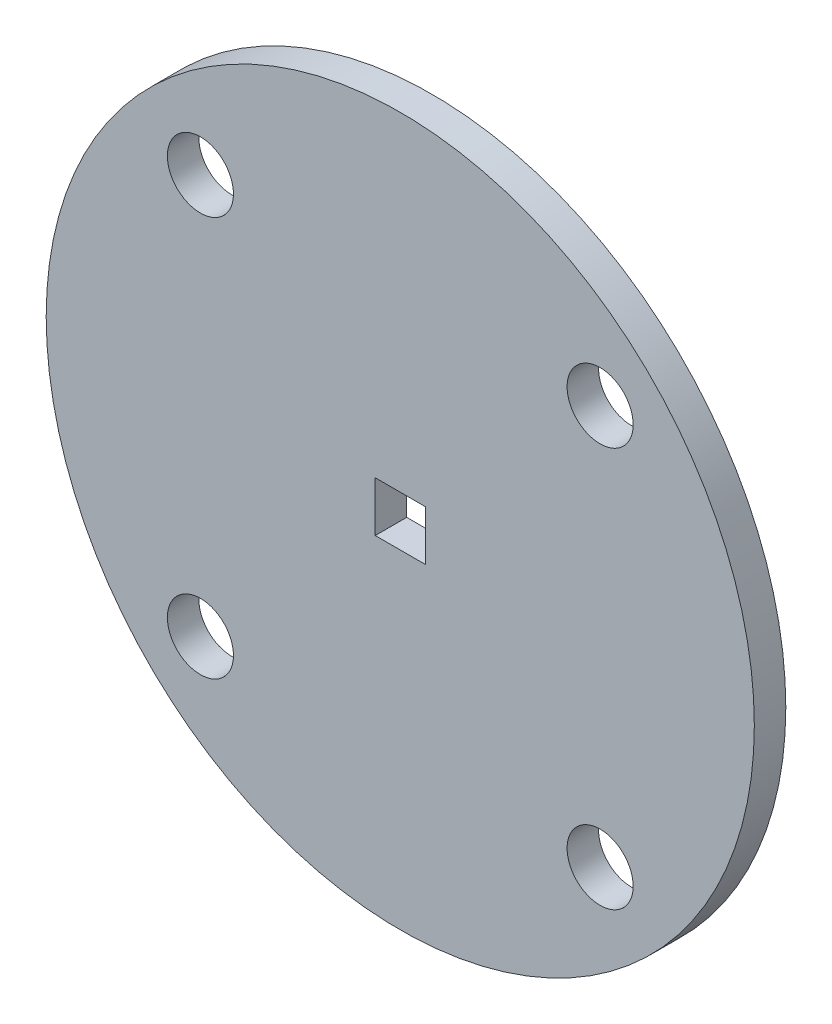
ISO-10303-21;
HEADER;
FILE_DESCRIPTION(('STEP AP214'),'2;1');
FILE_NAME('part.step','',(''),(''),'','','');
FILE_SCHEMA(('AUTOMOTIVE_DESIGN { 1 0 10303 214 1 1 1 1 }'));
ENDSEC;
DATA;
#1=APPLICATION_CONTEXT('core data for automotive mechanical design processes');
#2=APPLICATION_PROTOCOL_DEFINITION('international standard','automotive_design',2000,#1);
#3=PRODUCT_CONTEXT('',#1,'mechanical');
#4=PRODUCT('Part','Part','',(#3));
#5=PRODUCT_RELATED_PRODUCT_CATEGORY('part','',(#4));
#6=PRODUCT_DEFINITION_FORMATION('','',#4);
#7=PRODUCT_DEFINITION_CONTEXT('part definition',#1,'design');
#8=PRODUCT_DEFINITION('design','',#6,#7);
#9=PRODUCT_DEFINITION_SHAPE('','',#8);
#10=(LENGTH_UNIT() NAMED_UNIT(*) SI_UNIT(.MILLI.,.METRE.));
#11=(NAMED_UNIT(*) PLANE_ANGLE_UNIT() SI_UNIT($,.RADIAN.));
#12=(NAMED_UNIT(*) SI_UNIT($,.STERADIAN.) SOLID_ANGLE_UNIT());
#13=UNCERTAINTY_MEASURE_WITH_UNIT(LENGTH_MEASURE(1.E-05),#10,'distance_accuracy_value','');
#14=(GEOMETRIC_REPRESENTATION_CONTEXT(3) GLOBAL_UNCERTAINTY_ASSIGNED_CONTEXT((#13)) GLOBAL_UNIT_ASSIGNED_CONTEXT((#10,
#11,#12)) REPRESENTATION_CONTEXT('',''));
#15=CARTESIAN_POINT('',(0.,0.,0.));
#16=DIRECTION('',(0.,0.,1.));
#17=DIRECTION('',(1.,0.,0.));
#18=AXIS2_PLACEMENT_3D('',#15,#16,#17);
#19=CARTESIAN_POINT('',(0.,0.,-2.));
#20=DIRECTION('',(0.,0.,1.));
#21=DIRECTION('',(1.,0.,0.));
#22=AXIS2_PLACEMENT_3D('',#19,#20,#21);
#23=PLANE('',#22);
#24=DIRECTION('',(1.,0.,0.));
#25=VECTOR('',#24,1.);
#26=CARTESIAN_POINT('',(0.,-1.59,-2.));
#27=LINE('',#26,#25);
#28=CARTESIAN_POINT('',(-1.59,-1.59,-2.));
#29=VERTEX_POINT('',#28);
#30=CARTESIAN_POINT('',(1.59,-1.59,-2.));
#31=VERTEX_POINT('',#30);
#32=EDGE_CURVE('E109',#29,#31,#27,.T.);
#33=ORIENTED_EDGE('',*,*,#32,.T.);
#34=DIRECTION('',(0.,1.,0.));
#35=VECTOR('',#34,1.);
#36=CARTESIAN_POINT('',(1.59,0.,-2.));
#37=LINE('',#36,#35);
#38=CARTESIAN_POINT('',(1.59,1.59,-2.));
#39=VERTEX_POINT('',#38);
#40=EDGE_CURVE('E112',#31,#39,#37,.T.);
#41=ORIENTED_EDGE('',*,*,#40,.T.);
#42=DIRECTION('',(-1.,0.,0.));
#43=VECTOR('',#42,1.);
#44=CARTESIAN_POINT('',(0.,1.59,-2.));
#45=LINE('',#44,#43);
#46=CARTESIAN_POINT('',(-1.59,1.59,-2.));
#47=VERTEX_POINT('',#46);
#48=EDGE_CURVE('E104',#39,#47,#45,.T.);
#49=ORIENTED_EDGE('',*,*,#48,.T.);
#50=DIRECTION('',(0.,-1.,0.));
#51=VECTOR('',#50,1.);
#52=CARTESIAN_POINT('',(-1.59,0.,-2.));
#53=LINE('',#52,#51);
#54=EDGE_CURVE('E85',#47,#29,#53,.T.);
#55=ORIENTED_EDGE('',*,*,#54,.T.);
#56=EDGE_LOOP('',(#33,#41,#49,#55));
#57=FACE_BOUND('',#56,.T.);
#58=CARTESIAN_POINT('',(-12.7,12.7,-2.));
#59=DIRECTION('',(0.,0.,1.));
#60=DIRECTION('',(1.,0.,0.));
#61=AXIS2_PLACEMENT_3D('',#58,#59,#60);
#62=CIRCLE('',#61,2.1);
#63=CARTESIAN_POINT('',(-10.6,12.7,-2.));
#64=VERTEX_POINT('',#63);
#65=EDGE_CURVE('E115',#64,#64,#62,.T.);
#66=ORIENTED_EDGE('',*,*,#65,.T.);
#67=EDGE_LOOP('',(#66));
#68=FACE_BOUND('',#67,.T.);
#69=CARTESIAN_POINT('',(12.7,12.7,-2.));
#70=DIRECTION('',(0.,0.,1.));
#71=DIRECTION('',(1.,0.,0.));
#72=AXIS2_PLACEMENT_3D('',#69,#70,#71);
#73=CIRCLE('',#72,2.1);
#74=CARTESIAN_POINT('',(14.8,12.7,-2.));
#75=VERTEX_POINT('',#74);
#76=EDGE_CURVE('E118',#75,#75,#73,.T.);
#77=ORIENTED_EDGE('',*,*,#76,.T.);
#78=EDGE_LOOP('',(#77));
#79=FACE_BOUND('',#78,.T.);
#80=CARTESIAN_POINT('',(12.7,-12.7,-2.));
#81=DIRECTION('',(0.,0.,1.));
#82=DIRECTION('',(1.,0.,0.));
#83=AXIS2_PLACEMENT_3D('',#80,#81,#82);
#84=CIRCLE('',#83,2.1);
#85=CARTESIAN_POINT('',(14.8,-12.7,-2.));
#86=VERTEX_POINT('',#85);
#87=EDGE_CURVE('E46',#86,#86,#84,.T.);
#88=ORIENTED_EDGE('',*,*,#87,.T.);
#89=EDGE_LOOP('',(#88));
#90=FACE_BOUND('',#89,.T.);
#91=CARTESIAN_POINT('',(-12.7,-12.7,-2.));
#92=DIRECTION('',(0.,0.,1.));
#93=DIRECTION('',(1.,0.,0.));
#94=AXIS2_PLACEMENT_3D('',#91,#92,#93);
#95=CIRCLE('',#94,2.1);
#96=CARTESIAN_POINT('',(-10.6,-12.7,-2.));
#97=VERTEX_POINT('',#96);
#98=EDGE_CURVE('E11',#97,#97,#95,.T.);
#99=ORIENTED_EDGE('',*,*,#98,.T.);
#100=EDGE_LOOP('',(#99));
#101=FACE_BOUND('',#100,.T.);
#102=CARTESIAN_POINT('',(0.,0.,-2.));
#103=DIRECTION('',(0.,0.,1.));
#104=DIRECTION('',(1.,0.,0.));
#105=AXIS2_PLACEMENT_3D('',#102,#103,#104);
#106=CIRCLE('',#105,22.5);
#107=CARTESIAN_POINT('',(22.5,0.,-2.));
#108=VERTEX_POINT('',#107);
#109=EDGE_CURVE('E171',#108,#108,#106,.T.);
#110=ORIENTED_EDGE('',*,*,#109,.F.);
#111=EDGE_LOOP('',(#110));
#112=FACE_BOUND('',#111,.T.);
#113=ADVANCED_FACE('F38',(#57,#68,#79,#90,#101,#112),#23,.F.);
#114=CARTESIAN_POINT('',(0.,0.,0.));
#115=DIRECTION('',(0.,0.,1.));
#116=DIRECTION('',(1.,0.,0.));
#117=AXIS2_PLACEMENT_3D('',#114,#115,#116);
#118=PLANE('',#117);
#119=DIRECTION('',(0.,1.,0.));
#120=VECTOR('',#119,1.);
#121=CARTESIAN_POINT('',(1.59,-1.59,0.));
#122=LINE('',#121,#120);
#123=CARTESIAN_POINT('',(1.59,-1.59,0.));
#124=VERTEX_POINT('',#123);
#125=CARTESIAN_POINT('',(1.59,1.59,0.));
#126=VERTEX_POINT('',#125);
#127=EDGE_CURVE('E61',#124,#126,#122,.T.);
#128=ORIENTED_EDGE('',*,*,#127,.F.);
#129=DIRECTION('',(1.,0.,0.));
#130=VECTOR('',#129,1.);
#131=CARTESIAN_POINT('',(-1.59,-1.59,0.));
#132=LINE('',#131,#130);
#133=CARTESIAN_POINT('',(-1.59,-1.59,0.));
#134=VERTEX_POINT('',#133);
#135=EDGE_CURVE('E97',#134,#124,#132,.T.);
#136=ORIENTED_EDGE('',*,*,#135,.F.);
#137=DIRECTION('',(0.,-1.,0.));
#138=VECTOR('',#137,1.);
#139=CARTESIAN_POINT('',(-1.59,-1.59,0.));
#140=LINE('',#139,#138);
#141=CARTESIAN_POINT('',(-1.59,1.59,0.));
#142=VERTEX_POINT('',#141);
#143=EDGE_CURVE('E82',#142,#134,#140,.T.);
#144=ORIENTED_EDGE('',*,*,#143,.F.);
#145=DIRECTION('',(-1.,0.,0.));
#146=VECTOR('',#145,1.);
#147=CARTESIAN_POINT('',(-1.59,1.59,0.));
#148=LINE('',#147,#146);
#149=EDGE_CURVE('E91',#126,#142,#148,.T.);
#150=ORIENTED_EDGE('',*,*,#149,.F.);
#151=EDGE_LOOP('',(#128,#136,#144,#150));
#152=FACE_BOUND('',#151,.T.);
#153=CARTESIAN_POINT('',(-12.7,12.7,0.));
#154=DIRECTION('',(0.,0.,1.));
#155=DIRECTION('',(1.,0.,0.));
#156=AXIS2_PLACEMENT_3D('',#153,#154,#155);
#157=CIRCLE('',#156,2.1);
#158=CARTESIAN_POINT('',(-10.6,12.7,0.));
#159=VERTEX_POINT('',#158);
#160=EDGE_CURVE('E162',#159,#159,#157,.T.);
#161=ORIENTED_EDGE('',*,*,#160,.F.);
#162=EDGE_LOOP('',(#161));
#163=FACE_BOUND('',#162,.T.);
#164=CARTESIAN_POINT('',(12.7,12.7,0.));
#165=DIRECTION('',(0.,0.,1.));
#166=DIRECTION('',(1.,0.,0.));
#167=AXIS2_PLACEMENT_3D('',#164,#165,#166);
#168=CIRCLE('',#167,2.1);
#169=CARTESIAN_POINT('',(14.8,12.7,0.));
#170=VERTEX_POINT('',#169);
#171=EDGE_CURVE('E164',#170,#170,#168,.T.);
#172=ORIENTED_EDGE('',*,*,#171,.F.);
#173=EDGE_LOOP('',(#172));
#174=FACE_BOUND('',#173,.T.);
#175=CARTESIAN_POINT('',(12.7,-12.7,0.));
#176=DIRECTION('',(0.,0.,1.));
#177=DIRECTION('',(1.,0.,0.));
#178=AXIS2_PLACEMENT_3D('',#175,#176,#177);
#179=CIRCLE('',#178,2.1);
#180=CARTESIAN_POINT('',(14.8,-12.7,0.));
#181=VERTEX_POINT('',#180);
#182=EDGE_CURVE('E170',#181,#181,#179,.T.);
#183=ORIENTED_EDGE('',*,*,#182,.F.);
#184=EDGE_LOOP('',(#183));
#185=FACE_BOUND('',#184,.T.);
#186=CARTESIAN_POINT('',(-12.7,-12.7,0.));
#187=DIRECTION('',(0.,0.,1.));
#188=DIRECTION('',(1.,0.,0.));
#189=AXIS2_PLACEMENT_3D('',#186,#187,#188);
#190=CIRCLE('',#189,2.1);
#191=CARTESIAN_POINT('',(-10.6,-12.7,0.));
#192=VERTEX_POINT('',#191);
#193=EDGE_CURVE('E167',#192,#192,#190,.T.);
#194=ORIENTED_EDGE('',*,*,#193,.F.);
#195=EDGE_LOOP('',(#194));
#196=FACE_BOUND('',#195,.T.);
#197=CARTESIAN_POINT('',(0.,0.,0.));
#198=DIRECTION('',(0.,0.,1.));
#199=DIRECTION('',(1.,0.,0.));
#200=AXIS2_PLACEMENT_3D('',#197,#198,#199);
#201=CIRCLE('',#200,22.5);
#202=CARTESIAN_POINT('',(22.5,0.,0.));
#203=VERTEX_POINT('',#202);
#204=EDGE_CURVE('E177',#203,#203,#201,.T.);
#205=ORIENTED_EDGE('',*,*,#204,.T.);
#206=EDGE_LOOP('',(#205));
#207=FACE_BOUND('',#206,.T.);
#208=ADVANCED_FACE('F40',(#152,#163,#174,#185,#196,#207),#118,.T.);
#209=CARTESIAN_POINT('',(1.59,-1.59,-10.));
#210=DIRECTION('',(1.,0.,0.));
#211=DIRECTION('',(0.,0.,-1.));
#212=AXIS2_PLACEMENT_3D('',#209,#210,#211);
#213=PLANE('',#212);
#214=DIRECTION('',(0.,0.,1.));
#215=VECTOR('',#214,1.);
#216=CARTESIAN_POINT('',(1.59,-1.59,-10.));
#217=LINE('',#216,#215);
#218=EDGE_CURVE('E102',#31,#124,#217,.T.);
#219=ORIENTED_EDGE('',*,*,#218,.T.);
#220=ORIENTED_EDGE('',*,*,#127,.T.);
#221=DIRECTION('',(0.,0.,1.));
#222=VECTOR('',#221,1.);
#223=CARTESIAN_POINT('',(1.59,1.59,-10.));
#224=LINE('',#223,#222);
#225=EDGE_CURVE('E88',#39,#126,#224,.T.);
#226=ORIENTED_EDGE('',*,*,#225,.F.);
#227=ORIENTED_EDGE('',*,*,#40,.F.);
#228=EDGE_LOOP('',(#219,#220,#226,#227));
#229=FACE_BOUND('',#228,.T.);
#230=ADVANCED_FACE('F147',(#229),#213,.F.);
#231=CARTESIAN_POINT('',(-1.59,-1.59,-10.));
#232=DIRECTION('',(0.,-1.,0.));
#233=DIRECTION('',(0.,0.,-1.));
#234=AXIS2_PLACEMENT_3D('',#231,#232,#233);
#235=PLANE('',#234);
#236=DIRECTION('',(0.,0.,1.));
#237=VECTOR('',#236,1.);
#238=CARTESIAN_POINT('',(-1.59,-1.59,-10.));
#239=LINE('',#238,#237);
#240=EDGE_CURVE('E87',#29,#134,#239,.T.);
#241=ORIENTED_EDGE('',*,*,#240,.T.);
#242=ORIENTED_EDGE('',*,*,#135,.T.);
#243=ORIENTED_EDGE('',*,*,#218,.F.);
#244=ORIENTED_EDGE('',*,*,#32,.F.);
#245=EDGE_LOOP('',(#241,#242,#243,#244));
#246=FACE_BOUND('',#245,.T.);
#247=ADVANCED_FACE('F152',(#246),#235,.F.);
#248=CARTESIAN_POINT('',(-1.59,-1.59,-10.));
#249=DIRECTION('',(-1.,0.,0.));
#250=DIRECTION('',(0.,0.,1.));
#251=AXIS2_PLACEMENT_3D('',#248,#249,#250);
#252=PLANE('',#251);
#253=DIRECTION('',(0.,0.,1.));
#254=VECTOR('',#253,1.);
#255=CARTESIAN_POINT('',(-1.59,1.59,-10.));
#256=LINE('',#255,#254);
#257=EDGE_CURVE('E53',#47,#142,#256,.T.);
#258=ORIENTED_EDGE('',*,*,#257,.T.);
#259=ORIENTED_EDGE('',*,*,#143,.T.);
#260=ORIENTED_EDGE('',*,*,#240,.F.);
#261=ORIENTED_EDGE('',*,*,#54,.F.);
#262=EDGE_LOOP('',(#258,#259,#260,#261));
#263=FACE_BOUND('',#262,.T.);
#264=ADVANCED_FACE('F79',(#263),#252,.F.);
#265=CARTESIAN_POINT('',(-1.59,1.59,-10.));
#266=DIRECTION('',(0.,1.,0.));
#267=DIRECTION('',(0.,0.,1.));
#268=AXIS2_PLACEMENT_3D('',#265,#266,#267);
#269=PLANE('',#268);
#270=ORIENTED_EDGE('',*,*,#225,.T.);
#271=ORIENTED_EDGE('',*,*,#149,.T.);
#272=ORIENTED_EDGE('',*,*,#257,.F.);
#273=ORIENTED_EDGE('',*,*,#48,.F.);
#274=EDGE_LOOP('',(#270,#271,#272,#273));
#275=FACE_BOUND('',#274,.T.);
#276=ADVANCED_FACE('F92',(#275),#269,.F.);
#277=CARTESIAN_POINT('',(-12.7,12.7,-10.));
#278=DIRECTION('',(0.,0.,1.));
#279=DIRECTION('',(1.,0.,0.));
#280=AXIS2_PLACEMENT_3D('',#277,#278,#279);
#281=CYLINDRICAL_SURFACE('',#280,2.1);
#282=ORIENTED_EDGE('',*,*,#160,.T.);
#283=EDGE_LOOP('',(#282));
#284=FACE_BOUND('',#283,.T.);
#285=ORIENTED_EDGE('',*,*,#65,.F.);
#286=EDGE_LOOP('',(#285));
#287=FACE_BOUND('',#286,.T.);
#288=ADVANCED_FACE('F138',(#284,#287),#281,.F.);
#289=CARTESIAN_POINT('',(12.7,12.7,-10.));
#290=DIRECTION('',(0.,0.,1.));
#291=DIRECTION('',(1.,0.,0.));
#292=AXIS2_PLACEMENT_3D('',#289,#290,#291);
#293=CYLINDRICAL_SURFACE('',#292,2.1);
#294=ORIENTED_EDGE('',*,*,#171,.T.);
#295=EDGE_LOOP('',(#294));
#296=FACE_BOUND('',#295,.T.);
#297=ORIENTED_EDGE('',*,*,#76,.F.);
#298=EDGE_LOOP('',(#297));
#299=FACE_BOUND('',#298,.T.);
#300=ADVANCED_FACE('F128',(#296,#299),#293,.F.);
#301=CARTESIAN_POINT('',(12.7,-12.7,-10.));
#302=DIRECTION('',(0.,0.,1.));
#303=DIRECTION('',(1.,0.,0.));
#304=AXIS2_PLACEMENT_3D('',#301,#302,#303);
#305=CYLINDRICAL_SURFACE('',#304,2.1);
#306=ORIENTED_EDGE('',*,*,#182,.T.);
#307=EDGE_LOOP('',(#306));
#308=FACE_BOUND('',#307,.T.);
#309=ORIENTED_EDGE('',*,*,#87,.F.);
#310=EDGE_LOOP('',(#309));
#311=FACE_BOUND('',#310,.T.);
#312=ADVANCED_FACE('F125',(#308,#311),#305,.F.);
#313=CARTESIAN_POINT('',(-12.7,-12.7,-10.));
#314=DIRECTION('',(0.,0.,1.));
#315=DIRECTION('',(1.,0.,0.));
#316=AXIS2_PLACEMENT_3D('',#313,#314,#315);
#317=CYLINDRICAL_SURFACE('',#316,2.1);
#318=ORIENTED_EDGE('',*,*,#193,.T.);
#319=EDGE_LOOP('',(#318));
#320=FACE_BOUND('',#319,.T.);
#321=ORIENTED_EDGE('',*,*,#98,.F.);
#322=EDGE_LOOP('',(#321));
#323=FACE_BOUND('',#322,.T.);
#324=ADVANCED_FACE('F127',(#320,#323),#317,.F.);
#325=CARTESIAN_POINT('',(0.,0.,-10.));
#326=DIRECTION('',(0.,0.,1.));
#327=DIRECTION('',(1.,0.,0.));
#328=AXIS2_PLACEMENT_3D('',#325,#326,#327);
#329=CYLINDRICAL_SURFACE('',#328,22.5);
#330=ORIENTED_EDGE('',*,*,#204,.F.);
#331=EDGE_LOOP('',(#330));
#332=FACE_BOUND('',#331,.T.);
#333=ORIENTED_EDGE('',*,*,#109,.T.);
#334=EDGE_LOOP('',(#333));
#335=FACE_BOUND('',#334,.T.);
#336=ADVANCED_FACE('F135',(#332,#335),#329,.T.);
#337=CLOSED_SHELL('',(#113,#208,#230,#247,#264,#276,#288,#300,#312,#324,#336));
#338=MANIFOLD_SOLID_BREP('B2',#337);
#339=ADVANCED_BREP_SHAPE_REPRESENTATION('',(#18,#338),#14);
#340=SHAPE_DEFINITION_REPRESENTATION(#9,#339);
ENDSEC;
END-ISO-10303-21;
